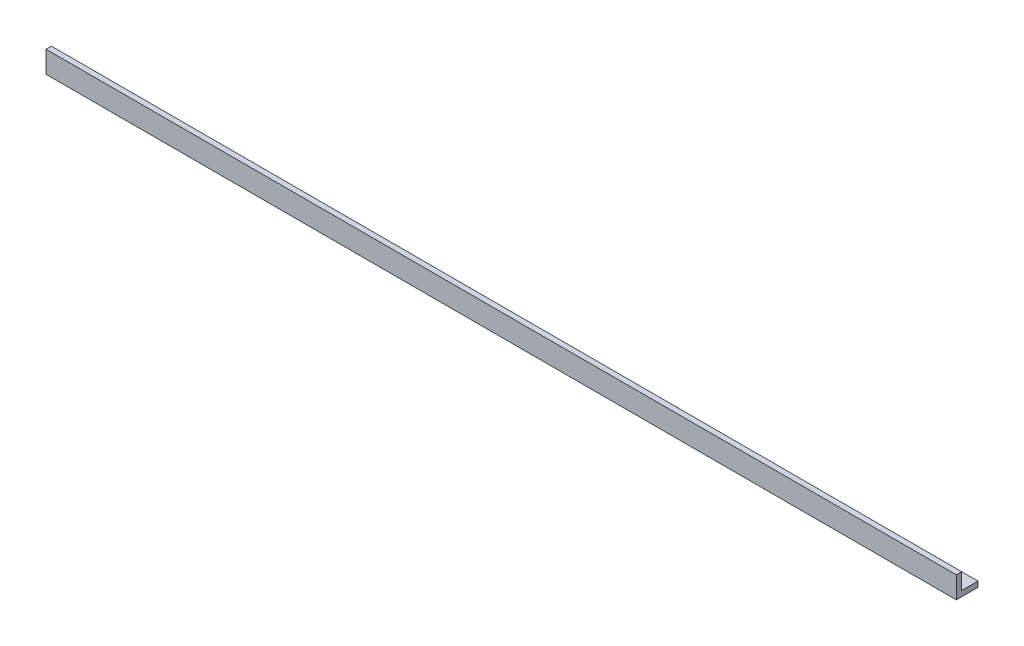
ISO-10303-21;
HEADER;
FILE_DESCRIPTION(('STEP AP214'),'2;1');
FILE_NAME('part.step','',(''),(''),'','','');
FILE_SCHEMA(('AUTOMOTIVE_DESIGN { 1 0 10303 214 1 1 1 1 }'));
ENDSEC;
DATA;
#1=APPLICATION_CONTEXT('core data for automotive mechanical design processes');
#2=APPLICATION_PROTOCOL_DEFINITION('international standard','automotive_design',2000,#1);
#3=PRODUCT_CONTEXT('',#1,'mechanical');
#4=PRODUCT('Part','Part','',(#3));
#5=PRODUCT_RELATED_PRODUCT_CATEGORY('part','',(#4));
#6=PRODUCT_DEFINITION_FORMATION('','',#4);
#7=PRODUCT_DEFINITION_CONTEXT('part definition',#1,'design');
#8=PRODUCT_DEFINITION('design','',#6,#7);
#9=PRODUCT_DEFINITION_SHAPE('','',#8);
#10=(LENGTH_UNIT() NAMED_UNIT(*) SI_UNIT(.MILLI.,.METRE.));
#11=(NAMED_UNIT(*) PLANE_ANGLE_UNIT() SI_UNIT($,.RADIAN.));
#12=(NAMED_UNIT(*) SI_UNIT($,.STERADIAN.) SOLID_ANGLE_UNIT());
#13=UNCERTAINTY_MEASURE_WITH_UNIT(LENGTH_MEASURE(1.E-05),#10,'distance_accuracy_value','');
#14=(GEOMETRIC_REPRESENTATION_CONTEXT(3) GLOBAL_UNCERTAINTY_ASSIGNED_CONTEXT((#13)) GLOBAL_UNIT_ASSIGNED_CONTEXT((#10,
#11,#12)) REPRESENTATION_CONTEXT('',''));
#15=CARTESIAN_POINT('',(0.,0.,0.));
#16=DIRECTION('',(0.,0.,1.));
#17=DIRECTION('',(1.,0.,0.));
#18=AXIS2_PLACEMENT_3D('',#15,#16,#17);
#19=CARTESIAN_POINT('',(-533.4,0.,-25.4));
#20=DIRECTION('',(0.,0.,1.));
#21=DIRECTION('',(1.,0.,0.));
#22=AXIS2_PLACEMENT_3D('',#19,#20,#21);
#23=PLANE('',#22);
#24=DIRECTION('',(1.,0.,0.));
#25=VECTOR('',#24,1.);
#26=CARTESIAN_POINT('',(-533.4,6.35,-25.4));
#27=LINE('',#26,#25);
#28=CARTESIAN_POINT('',(-533.4,6.35,-25.4));
#29=VERTEX_POINT('',#28);
#30=CARTESIAN_POINT('',(533.4,6.35,-25.4));
#31=VERTEX_POINT('',#30);
#32=EDGE_CURVE('E42',#29,#31,#27,.T.);
#33=ORIENTED_EDGE('',*,*,#32,.T.);
#34=DIRECTION('',(0.,-1.,0.));
#35=VECTOR('',#34,1.);
#36=CARTESIAN_POINT('',(533.4,0.,-25.4));
#37=LINE('',#36,#35);
#38=CARTESIAN_POINT('',(533.4,0.,-25.4));
#39=VERTEX_POINT('',#38);
#40=EDGE_CURVE('E94',#31,#39,#37,.T.);
#41=ORIENTED_EDGE('',*,*,#40,.T.);
#42=DIRECTION('',(1.,0.,0.));
#43=VECTOR('',#42,1.);
#44=CARTESIAN_POINT('',(-533.4,0.,-25.4));
#45=LINE('',#44,#43);
#46=CARTESIAN_POINT('',(-533.4,0.,-25.4));
#47=VERTEX_POINT('',#46);
#48=EDGE_CURVE('E11',#47,#39,#45,.T.);
#49=ORIENTED_EDGE('',*,*,#48,.F.);
#50=DIRECTION('',(0.,-1.,0.));
#51=VECTOR('',#50,1.);
#52=CARTESIAN_POINT('',(-533.4,0.,-25.4));
#53=LINE('',#52,#51);
#54=EDGE_CURVE('E55',#29,#47,#53,.T.);
#55=ORIENTED_EDGE('',*,*,#54,.F.);
#56=EDGE_LOOP('',(#33,#41,#49,#55));
#57=FACE_BOUND('',#56,.T.);
#58=ADVANCED_FACE('F39',(#57),#23,.F.);
#59=CARTESIAN_POINT('',(-533.4,0.,0.));
#60=DIRECTION('',(0.,-1.,0.));
#61=DIRECTION('',(0.,0.,-1.));
#62=AXIS2_PLACEMENT_3D('',#59,#60,#61);
#63=PLANE('',#62);
#64=ORIENTED_EDGE('',*,*,#48,.T.);
#65=DIRECTION('',(0.,0.,-1.));
#66=VECTOR('',#65,1.);
#67=CARTESIAN_POINT('',(533.4,0.,0.));
#68=LINE('',#67,#66);
#69=CARTESIAN_POINT('',(533.4,0.,0.));
#70=VERTEX_POINT('',#69);
#71=EDGE_CURVE('E108',#70,#39,#68,.T.);
#72=ORIENTED_EDGE('',*,*,#71,.F.);
#73=DIRECTION('',(1.,0.,0.));
#74=VECTOR('',#73,1.);
#75=CARTESIAN_POINT('',(-533.4,0.,0.));
#76=LINE('',#75,#74);
#77=CARTESIAN_POINT('',(-533.4,0.,0.));
#78=VERTEX_POINT('',#77);
#79=EDGE_CURVE('E47',#78,#70,#76,.T.);
#80=ORIENTED_EDGE('',*,*,#79,.F.);
#81=DIRECTION('',(0.,0.,-1.));
#82=VECTOR('',#81,1.);
#83=CARTESIAN_POINT('',(-533.4,0.,0.));
#84=LINE('',#83,#82);
#85=EDGE_CURVE('E99',#78,#47,#84,.T.);
#86=ORIENTED_EDGE('',*,*,#85,.T.);
#87=EDGE_LOOP('',(#64,#72,#80,#86));
#88=FACE_BOUND('',#87,.T.);
#89=ADVANCED_FACE('F148',(#88),#63,.T.);
#90=CARTESIAN_POINT('',(-533.4,0.,0.));
#91=DIRECTION('',(0.,0.,1.));
#92=DIRECTION('',(1.,0.,0.));
#93=AXIS2_PLACEMENT_3D('',#90,#91,#92);
#94=PLANE('',#93);
#95=ORIENTED_EDGE('',*,*,#79,.T.);
#96=DIRECTION('',(0.,-1.,0.));
#97=VECTOR('',#96,1.);
#98=CARTESIAN_POINT('',(533.4,0.,0.));
#99=LINE('',#98,#97);
#100=CARTESIAN_POINT('',(533.4,25.4,0.));
#101=VERTEX_POINT('',#100);
#102=EDGE_CURVE('E119',#101,#70,#99,.T.);
#103=ORIENTED_EDGE('',*,*,#102,.F.);
#104=DIRECTION('',(1.,0.,0.));
#105=VECTOR('',#104,1.);
#106=CARTESIAN_POINT('',(-533.4,25.4,0.));
#107=LINE('',#106,#105);
#108=CARTESIAN_POINT('',(-533.4,25.4,0.));
#109=VERTEX_POINT('',#108);
#110=EDGE_CURVE('E133',#109,#101,#107,.T.);
#111=ORIENTED_EDGE('',*,*,#110,.F.);
#112=DIRECTION('',(0.,-1.,0.));
#113=VECTOR('',#112,1.);
#114=CARTESIAN_POINT('',(-533.4,0.,0.));
#115=LINE('',#114,#113);
#116=EDGE_CURVE('E129',#109,#78,#115,.T.);
#117=ORIENTED_EDGE('',*,*,#116,.T.);
#118=EDGE_LOOP('',(#95,#103,#111,#117));
#119=FACE_BOUND('',#118,.T.);
#120=ADVANCED_FACE('F147',(#119),#94,.T.);
#121=CARTESIAN_POINT('',(-533.4,25.4,0.));
#122=DIRECTION('',(0.,-1.,0.));
#123=DIRECTION('',(0.,0.,-1.));
#124=AXIS2_PLACEMENT_3D('',#121,#122,#123);
#125=PLANE('',#124);
#126=ORIENTED_EDGE('',*,*,#110,.T.);
#127=DIRECTION('',(0.,0.,-1.));
#128=VECTOR('',#127,1.);
#129=CARTESIAN_POINT('',(533.4,25.4,0.));
#130=LINE('',#129,#128);
#131=CARTESIAN_POINT('',(533.4,25.4,-6.35));
#132=VERTEX_POINT('',#131);
#133=EDGE_CURVE('E114',#101,#132,#130,.T.);
#134=ORIENTED_EDGE('',*,*,#133,.T.);
#135=DIRECTION('',(1.,0.,0.));
#136=VECTOR('',#135,1.);
#137=CARTESIAN_POINT('',(-533.4,25.4,-6.35));
#138=LINE('',#137,#136);
#139=CARTESIAN_POINT('',(-533.4,25.4,-6.35));
#140=VERTEX_POINT('',#139);
#141=EDGE_CURVE('E135',#140,#132,#138,.T.);
#142=ORIENTED_EDGE('',*,*,#141,.F.);
#143=DIRECTION('',(0.,0.,-1.));
#144=VECTOR('',#143,1.);
#145=CARTESIAN_POINT('',(-533.4,25.4,0.));
#146=LINE('',#145,#144);
#147=EDGE_CURVE('E127',#109,#140,#146,.T.);
#148=ORIENTED_EDGE('',*,*,#147,.F.);
#149=EDGE_LOOP('',(#126,#134,#142,#148));
#150=FACE_BOUND('',#149,.T.);
#151=ADVANCED_FACE('F143',(#150),#125,.F.);
#152=CARTESIAN_POINT('',(-533.4,0.,-6.35));
#153=DIRECTION('',(0.,0.,1.));
#154=DIRECTION('',(1.,0.,0.));
#155=AXIS2_PLACEMENT_3D('',#152,#153,#154);
#156=PLANE('',#155);
#157=ORIENTED_EDGE('',*,*,#141,.T.);
#158=DIRECTION('',(0.,-1.,0.));
#159=VECTOR('',#158,1.);
#160=CARTESIAN_POINT('',(533.4,0.,-6.35));
#161=LINE('',#160,#159);
#162=CARTESIAN_POINT('',(533.4,6.35,-6.35));
#163=VERTEX_POINT('',#162);
#164=EDGE_CURVE('E112',#132,#163,#161,.T.);
#165=ORIENTED_EDGE('',*,*,#164,.T.);
#166=DIRECTION('',(1.,0.,0.));
#167=VECTOR('',#166,1.);
#168=CARTESIAN_POINT('',(-533.4,6.35,-6.35));
#169=LINE('',#168,#167);
#170=CARTESIAN_POINT('',(-533.4,6.35,-6.35));
#171=VERTEX_POINT('',#170);
#172=EDGE_CURVE('E98',#171,#163,#169,.T.);
#173=ORIENTED_EDGE('',*,*,#172,.F.);
#174=DIRECTION('',(0.,-1.,0.));
#175=VECTOR('',#174,1.);
#176=CARTESIAN_POINT('',(-533.4,0.,-6.35));
#177=LINE('',#176,#175);
#178=EDGE_CURVE('E125',#140,#171,#177,.T.);
#179=ORIENTED_EDGE('',*,*,#178,.F.);
#180=EDGE_LOOP('',(#157,#165,#173,#179));
#181=FACE_BOUND('',#180,.T.);
#182=ADVANCED_FACE('F139',(#181),#156,.F.);
#183=CARTESIAN_POINT('',(-533.4,6.35,0.));
#184=DIRECTION('',(0.,-1.,0.));
#185=DIRECTION('',(0.,0.,-1.));
#186=AXIS2_PLACEMENT_3D('',#183,#184,#185);
#187=PLANE('',#186);
#188=ORIENTED_EDGE('',*,*,#172,.T.);
#189=DIRECTION('',(0.,0.,-1.));
#190=VECTOR('',#189,1.);
#191=CARTESIAN_POINT('',(533.4,6.35,0.));
#192=LINE('',#191,#190);
#193=EDGE_CURVE('E105',#163,#31,#192,.T.);
#194=ORIENTED_EDGE('',*,*,#193,.T.);
#195=ORIENTED_EDGE('',*,*,#32,.F.);
#196=DIRECTION('',(0.,0.,-1.));
#197=VECTOR('',#196,1.);
#198=CARTESIAN_POINT('',(-533.4,6.35,0.));
#199=LINE('',#198,#197);
#200=EDGE_CURVE('E123',#171,#29,#199,.T.);
#201=ORIENTED_EDGE('',*,*,#200,.F.);
#202=EDGE_LOOP('',(#188,#194,#195,#201));
#203=FACE_BOUND('',#202,.T.);
#204=ADVANCED_FACE('F110',(#203),#187,.F.);
#205=CARTESIAN_POINT('',(-533.4,0.,0.));
#206=DIRECTION('',(1.,0.,0.));
#207=DIRECTION('',(0.,0.,-1.));
#208=AXIS2_PLACEMENT_3D('',#205,#206,#207);
#209=PLANE('',#208);
#210=ORIENTED_EDGE('',*,*,#54,.T.);
#211=ORIENTED_EDGE('',*,*,#85,.F.);
#212=ORIENTED_EDGE('',*,*,#116,.F.);
#213=ORIENTED_EDGE('',*,*,#147,.T.);
#214=ORIENTED_EDGE('',*,*,#178,.T.);
#215=ORIENTED_EDGE('',*,*,#200,.T.);
#216=EDGE_LOOP('',(#210,#211,#212,#213,#214,#215));
#217=FACE_BOUND('',#216,.T.);
#218=ADVANCED_FACE('F149',(#217),#209,.F.);
#219=CARTESIAN_POINT('',(533.4,0.,0.));
#220=DIRECTION('',(1.,0.,0.));
#221=DIRECTION('',(0.,0.,-1.));
#222=AXIS2_PLACEMENT_3D('',#219,#220,#221);
#223=PLANE('',#222);
#224=ORIENTED_EDGE('',*,*,#40,.F.);
#225=ORIENTED_EDGE('',*,*,#193,.F.);
#226=ORIENTED_EDGE('',*,*,#164,.F.);
#227=ORIENTED_EDGE('',*,*,#133,.F.);
#228=ORIENTED_EDGE('',*,*,#102,.T.);
#229=ORIENTED_EDGE('',*,*,#71,.T.);
#230=EDGE_LOOP('',(#224,#225,#226,#227,#228,#229));
#231=FACE_BOUND('',#230,.T.);
#232=ADVANCED_FACE('F103',(#231),#223,.T.);
#233=CLOSED_SHELL('',(#58,#89,#120,#151,#182,#204,#218,#232));
#234=MANIFOLD_SOLID_BREP('B2',#233);
#235=ADVANCED_BREP_SHAPE_REPRESENTATION('',(#18,#234),#14);
#236=SHAPE_DEFINITION_REPRESENTATION(#9,#235);
ENDSEC;
END-ISO-10303-21;
